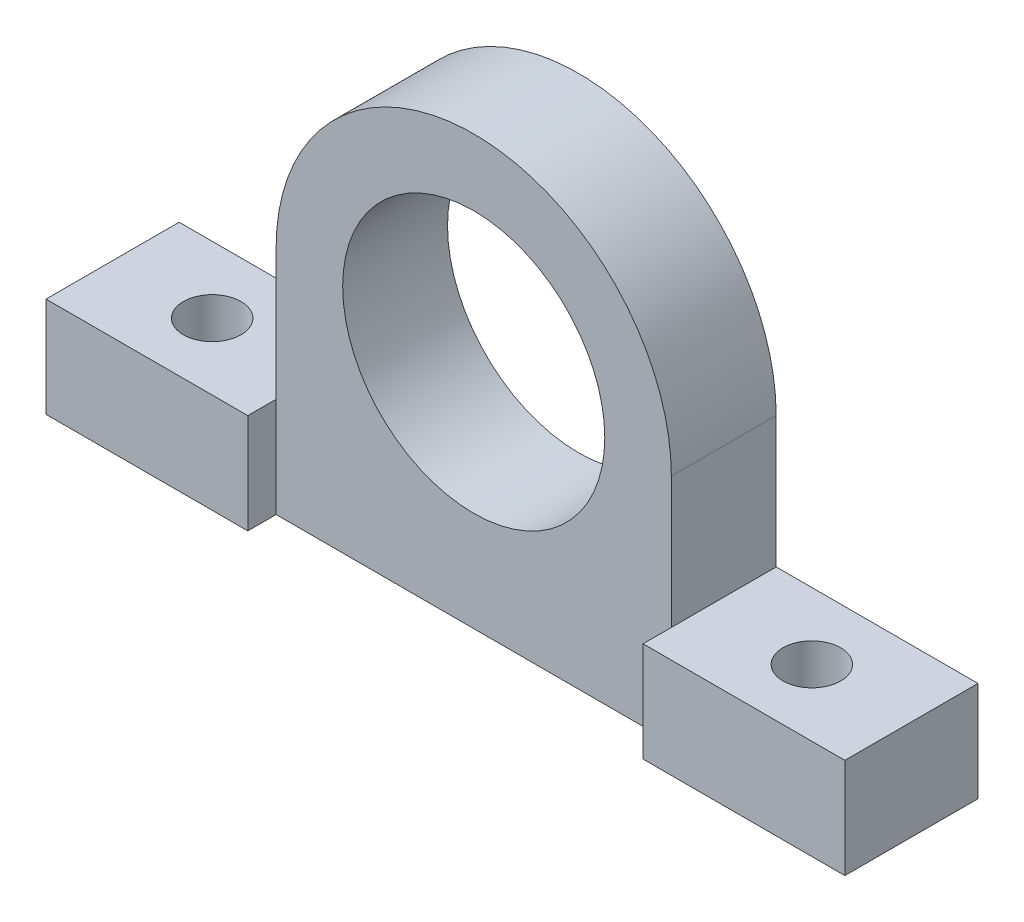
ISO-10303-21;
HEADER;
FILE_DESCRIPTION(('STEP AP214'),'2;1');
FILE_NAME('part.step','',(''),(''),'','','');
FILE_SCHEMA(('AUTOMOTIVE_DESIGN { 1 0 10303 214 1 1 1 1 }'));
ENDSEC;
DATA;
#1=APPLICATION_CONTEXT('core data for automotive mechanical design processes');
#2=APPLICATION_PROTOCOL_DEFINITION('international standard','automotive_design',2000,#1);
#3=PRODUCT_CONTEXT('',#1,'mechanical');
#4=PRODUCT('Part','Part','',(#3));
#5=PRODUCT_RELATED_PRODUCT_CATEGORY('part','',(#4));
#6=PRODUCT_DEFINITION_FORMATION('','',#4);
#7=PRODUCT_DEFINITION_CONTEXT('part definition',#1,'design');
#8=PRODUCT_DEFINITION('design','',#6,#7);
#9=PRODUCT_DEFINITION_SHAPE('','',#8);
#10=(LENGTH_UNIT() NAMED_UNIT(*) SI_UNIT(.MILLI.,.METRE.));
#11=(NAMED_UNIT(*) PLANE_ANGLE_UNIT() SI_UNIT($,.RADIAN.));
#12=(NAMED_UNIT(*) SI_UNIT($,.STERADIAN.) SOLID_ANGLE_UNIT());
#13=UNCERTAINTY_MEASURE_WITH_UNIT(LENGTH_MEASURE(1.E-05),#10,'distance_accuracy_value','');
#14=(GEOMETRIC_REPRESENTATION_CONTEXT(3) GLOBAL_UNCERTAINTY_ASSIGNED_CONTEXT((#13)) GLOBAL_UNIT_ASSIGNED_CONTEXT((#10,
#11,#12)) REPRESENTATION_CONTEXT('',''));
#15=CARTESIAN_POINT('',(0.,0.,0.));
#16=DIRECTION('',(0.,0.,1.));
#17=DIRECTION('',(1.,0.,0.));
#18=AXIS2_PLACEMENT_3D('',#15,#16,#17);
#19=CARTESIAN_POINT('',(0.,0.,20.));
#20=DIRECTION('',(0.,0.,1.));
#21=DIRECTION('',(1.,0.,0.));
#22=AXIS2_PLACEMENT_3D('',#19,#20,#21);
#23=PLANE('',#22);
#24=CARTESIAN_POINT('',(0.,0.,20.));
#25=DIRECTION('',(0.,0.,1.));
#26=DIRECTION('',(1.,0.,0.));
#27=AXIS2_PLACEMENT_3D('',#24,#25,#26);
#28=CIRCLE('',#27,25.);
#29=CARTESIAN_POINT('',(25.,0.,20.));
#30=VERTEX_POINT('',#29);
#31=EDGE_CURVE('E106',#30,#30,#28,.T.);
#32=ORIENTED_EDGE('',*,*,#31,.F.);
#33=EDGE_LOOP('',(#32));
#34=FACE_BOUND('',#33,.T.);
#35=DIRECTION('',(1.,0.,0.));
#36=VECTOR('',#35,1.);
#37=CARTESIAN_POINT('',(0.,-44.05,20.));
#38=LINE('',#37,#36);
#39=CARTESIAN_POINT('',(-37.7,-44.05,20.));
#40=VERTEX_POINT('',#39);
#41=CARTESIAN_POINT('',(37.7,-44.05,20.));
#42=VERTEX_POINT('',#41);
#43=EDGE_CURVE('E142',#40,#42,#38,.T.);
#44=ORIENTED_EDGE('',*,*,#43,.T.);
#45=DIRECTION('',(0.,-1.,0.));
#46=VECTOR('',#45,1.);
#47=CARTESIAN_POINT('',(37.7,0.,20.));
#48=LINE('',#47,#46);
#49=CARTESIAN_POINT('',(37.7,-25.,20.));
#50=VERTEX_POINT('',#49);
#51=EDGE_CURVE('E158',#50,#42,#48,.T.);
#52=ORIENTED_EDGE('',*,*,#51,.F.);
#53=DIRECTION('',(0.,1.,0.));
#54=VECTOR('',#53,1.);
#55=CARTESIAN_POINT('',(37.7,0.,20.));
#56=LINE('',#55,#54);
#57=CARTESIAN_POINT('',(37.7,0.,20.));
#58=VERTEX_POINT('',#57);
#59=EDGE_CURVE('E146',#50,#58,#56,.T.);
#60=ORIENTED_EDGE('',*,*,#59,.T.);
#61=CARTESIAN_POINT('',(0.,0.,20.));
#62=DIRECTION('',(0.,0.,1.));
#63=DIRECTION('',(1.,0.,0.));
#64=AXIS2_PLACEMENT_3D('',#61,#62,#63);
#65=CIRCLE('',#64,37.7);
#66=CARTESIAN_POINT('',(-37.7,0.,20.));
#67=VERTEX_POINT('',#66);
#68=EDGE_CURVE('E58',#58,#67,#65,.T.);
#69=ORIENTED_EDGE('',*,*,#68,.T.);
#70=DIRECTION('',(0.,1.,0.));
#71=VECTOR('',#70,1.);
#72=CARTESIAN_POINT('',(-37.7,0.,20.));
#73=LINE('',#72,#71);
#74=CARTESIAN_POINT('',(-37.7,-25.,20.));
#75=VERTEX_POINT('',#74);
#76=EDGE_CURVE('E95',#75,#67,#73,.T.);
#77=ORIENTED_EDGE('',*,*,#76,.F.);
#78=DIRECTION('',(0.,-1.,0.));
#79=VECTOR('',#78,1.);
#80=CARTESIAN_POINT('',(-37.7,0.,20.));
#81=LINE('',#80,#79);
#82=EDGE_CURVE('E147',#75,#40,#81,.T.);
#83=ORIENTED_EDGE('',*,*,#82,.T.);
#84=EDGE_LOOP('',(#44,#52,#60,#69,#77,#83));
#85=FACE_BOUND('',#84,.T.);
#86=ADVANCED_FACE('F32',(#34,#85),#23,.T.);
#87=CARTESIAN_POINT('',(-37.7,0.,20.));
#88=DIRECTION('',(-1.,0.,0.));
#89=DIRECTION('',(0.,0.,1.));
#90=AXIS2_PLACEMENT_3D('',#87,#88,#89);
#91=PLANE('',#90);
#92=DIRECTION('',(0.,1.,0.));
#93=VECTOR('',#92,1.);
#94=CARTESIAN_POINT('',(-37.7,0.,0.));
#95=LINE('',#94,#93);
#96=CARTESIAN_POINT('',(-37.7,-25.,0.));
#97=VERTEX_POINT('',#96);
#98=CARTESIAN_POINT('',(-37.7,0.,0.));
#99=VERTEX_POINT('',#98);
#100=EDGE_CURVE('E93',#97,#99,#95,.T.);
#101=ORIENTED_EDGE('',*,*,#100,.F.);
#102=DIRECTION('',(0.,0.,-1.));
#103=VECTOR('',#102,1.);
#104=CARTESIAN_POINT('',(-37.7,-25.,20.));
#105=LINE('',#104,#103);
#106=EDGE_CURVE('E11',#75,#97,#105,.T.);
#107=ORIENTED_EDGE('',*,*,#106,.F.);
#108=ORIENTED_EDGE('',*,*,#76,.T.);
#109=DIRECTION('',(0.,0.,-1.));
#110=VECTOR('',#109,1.);
#111=CARTESIAN_POINT('',(-37.7,0.,20.));
#112=LINE('',#111,#110);
#113=EDGE_CURVE('E88',#67,#99,#112,.T.);
#114=ORIENTED_EDGE('',*,*,#113,.T.);
#115=EDGE_LOOP('',(#101,#107,#108,#114));
#116=FACE_BOUND('',#115,.T.);
#117=ADVANCED_FACE('F90',(#116),#91,.T.);
#118=CARTESIAN_POINT('',(0.,-25.,20.));
#119=DIRECTION('',(0.,1.,0.));
#120=DIRECTION('',(0.,0.,1.));
#121=AXIS2_PLACEMENT_3D('',#118,#119,#120);
#122=PLANE('',#121);
#123=CARTESIAN_POINT('',(-57.2,-25.,12.7));
#124=DIRECTION('',(0.,1.,0.));
#125=DIRECTION('',(0.,0.,1.));
#126=AXIS2_PLACEMENT_3D('',#123,#124,#125);
#127=CIRCLE('',#126,5.49999999999999);
#128=CARTESIAN_POINT('',(-57.2,-25.,18.2));
#129=VERTEX_POINT('',#128);
#130=EDGE_CURVE('E232',#129,#129,#127,.T.);
#131=ORIENTED_EDGE('',*,*,#130,.F.);
#132=EDGE_LOOP('',(#131));
#133=FACE_BOUND('',#132,.T.);
#134=DIRECTION('',(1.,0.,0.));
#135=VECTOR('',#134,1.);
#136=CARTESIAN_POINT('',(0.,-25.,0.));
#137=LINE('',#136,#135);
#138=CARTESIAN_POINT('',(-76.2,-25.,0.));
#139=VERTEX_POINT('',#138);
#140=EDGE_CURVE('E112',#139,#97,#137,.T.);
#141=ORIENTED_EDGE('',*,*,#140,.F.);
#142=DIRECTION('',(0.,0.,-1.));
#143=VECTOR('',#142,1.);
#144=CARTESIAN_POINT('',(-76.2,-25.,20.));
#145=LINE('',#144,#143);
#146=CARTESIAN_POINT('',(-76.2,-25.,25.4));
#147=VERTEX_POINT('',#146);
#148=EDGE_CURVE('E41',#147,#139,#145,.T.);
#149=ORIENTED_EDGE('',*,*,#148,.F.);
#150=DIRECTION('',(-1.,0.,0.));
#151=VECTOR('',#150,1.);
#152=CARTESIAN_POINT('',(0.,-25.,25.4));
#153=LINE('',#152,#151);
#154=CARTESIAN_POINT('',(-37.7,-25.,25.4));
#155=VERTEX_POINT('',#154);
#156=EDGE_CURVE('E208',#155,#147,#153,.T.);
#157=ORIENTED_EDGE('',*,*,#156,.F.);
#158=DIRECTION('',(0.,0.,-1.));
#159=VECTOR('',#158,1.);
#160=CARTESIAN_POINT('',(-37.7,-25.,25.4));
#161=LINE('',#160,#159);
#162=EDGE_CURVE('E119',#155,#75,#161,.T.);
#163=ORIENTED_EDGE('',*,*,#162,.T.);
#164=ORIENTED_EDGE('',*,*,#106,.T.);
#165=EDGE_LOOP('',(#141,#149,#157,#163,#164));
#166=FACE_BOUND('',#165,.T.);
#167=ADVANCED_FACE('F192',(#133,#166),#122,.T.);
#168=CARTESIAN_POINT('',(-76.2,0.,20.));
#169=DIRECTION('',(-1.,0.,0.));
#170=DIRECTION('',(0.,0.,1.));
#171=AXIS2_PLACEMENT_3D('',#168,#169,#170);
#172=PLANE('',#171);
#173=DIRECTION('',(0.,1.,0.));
#174=VECTOR('',#173,1.);
#175=CARTESIAN_POINT('',(-76.2,0.,0.));
#176=LINE('',#175,#174);
#177=CARTESIAN_POINT('',(-76.2,-44.05,0.));
#178=VERTEX_POINT('',#177);
#179=EDGE_CURVE('E115',#178,#139,#176,.T.);
#180=ORIENTED_EDGE('',*,*,#179,.F.);
#181=DIRECTION('',(0.,0.,-1.));
#182=VECTOR('',#181,1.);
#183=CARTESIAN_POINT('',(-76.2,-44.05,20.));
#184=LINE('',#183,#182);
#185=CARTESIAN_POINT('',(-76.2,-44.05,25.4));
#186=VERTEX_POINT('',#185);
#187=EDGE_CURVE('E139',#186,#178,#184,.T.);
#188=ORIENTED_EDGE('',*,*,#187,.F.);
#189=DIRECTION('',(0.,-1.,0.));
#190=VECTOR('',#189,1.);
#191=CARTESIAN_POINT('',(-76.2,0.,25.4));
#192=LINE('',#191,#190);
#193=EDGE_CURVE('E188',#147,#186,#192,.T.);
#194=ORIENTED_EDGE('',*,*,#193,.F.);
#195=ORIENTED_EDGE('',*,*,#148,.T.);
#196=EDGE_LOOP('',(#180,#188,#194,#195));
#197=FACE_BOUND('',#196,.T.);
#198=ADVANCED_FACE('F182',(#197),#172,.T.);
#199=CARTESIAN_POINT('',(0.,-44.05,20.));
#200=DIRECTION('',(0.,1.,0.));
#201=DIRECTION('',(0.,0.,1.));
#202=AXIS2_PLACEMENT_3D('',#199,#200,#201);
#203=PLANE('',#202);
#204=CARTESIAN_POINT('',(-57.2,-44.05,12.7));
#205=DIRECTION('',(0.,1.,0.));
#206=DIRECTION('',(0.,0.,1.));
#207=AXIS2_PLACEMENT_3D('',#204,#205,#206);
#208=CIRCLE('',#207,5.49999999999999);
#209=CARTESIAN_POINT('',(-57.2,-44.05,18.2));
#210=VERTEX_POINT('',#209);
#211=EDGE_CURVE('E36',#210,#210,#208,.T.);
#212=ORIENTED_EDGE('',*,*,#211,.T.);
#213=EDGE_LOOP('',(#212));
#214=FACE_BOUND('',#213,.T.);
#215=CARTESIAN_POINT('',(57.2,-44.05,12.7));
#216=DIRECTION('',(0.,1.,0.));
#217=DIRECTION('',(0.,0.,1.));
#218=AXIS2_PLACEMENT_3D('',#215,#216,#217);
#219=CIRCLE('',#218,5.49999999999999);
#220=CARTESIAN_POINT('',(57.2,-44.05,18.2));
#221=VERTEX_POINT('',#220);
#222=EDGE_CURVE('E220',#221,#221,#219,.T.);
#223=ORIENTED_EDGE('',*,*,#222,.T.);
#224=EDGE_LOOP('',(#223));
#225=FACE_BOUND('',#224,.T.);
#226=DIRECTION('',(1.,0.,0.));
#227=VECTOR('',#226,1.);
#228=CARTESIAN_POINT('',(0.,-44.05,0.));
#229=LINE('',#228,#227);
#230=CARTESIAN_POINT('',(76.2,-44.05,0.));
#231=VERTEX_POINT('',#230);
#232=EDGE_CURVE('E124',#178,#231,#229,.T.);
#233=ORIENTED_EDGE('',*,*,#232,.T.);
#234=DIRECTION('',(0.,0.,-1.));
#235=VECTOR('',#234,1.);
#236=CARTESIAN_POINT('',(76.2,-44.05,20.));
#237=LINE('',#236,#235);
#238=CARTESIAN_POINT('',(76.2,-44.05,25.4));
#239=VERTEX_POINT('',#238);
#240=EDGE_CURVE('E136',#239,#231,#237,.T.);
#241=ORIENTED_EDGE('',*,*,#240,.F.);
#242=DIRECTION('',(1.,0.,0.));
#243=VECTOR('',#242,1.);
#244=CARTESIAN_POINT('',(0.,-44.05,25.4));
#245=LINE('',#244,#243);
#246=CARTESIAN_POINT('',(37.7,-44.05,25.4));
#247=VERTEX_POINT('',#246);
#248=EDGE_CURVE('E222',#247,#239,#245,.T.);
#249=ORIENTED_EDGE('',*,*,#248,.F.);
#250=DIRECTION('',(0.,0.,-1.));
#251=VECTOR('',#250,1.);
#252=CARTESIAN_POINT('',(37.7,-44.05,25.4));
#253=LINE('',#252,#251);
#254=EDGE_CURVE('E215',#247,#42,#253,.T.);
#255=ORIENTED_EDGE('',*,*,#254,.T.);
#256=ORIENTED_EDGE('',*,*,#43,.F.);
#257=DIRECTION('',(0.,0.,-1.));
#258=VECTOR('',#257,1.);
#259=CARTESIAN_POINT('',(-37.7,-44.05,25.4));
#260=LINE('',#259,#258);
#261=CARTESIAN_POINT('',(-37.7,-44.05,25.4));
#262=VERTEX_POINT('',#261);
#263=EDGE_CURVE('E49',#262,#40,#260,.T.);
#264=ORIENTED_EDGE('',*,*,#263,.F.);
#265=DIRECTION('',(1.,0.,0.));
#266=VECTOR('',#265,1.);
#267=CARTESIAN_POINT('',(0.,-44.05,25.4));
#268=LINE('',#267,#266);
#269=EDGE_CURVE('E204',#186,#262,#268,.T.);
#270=ORIENTED_EDGE('',*,*,#269,.F.);
#271=ORIENTED_EDGE('',*,*,#187,.T.);
#272=EDGE_LOOP('',(#233,#241,#249,#255,#256,#264,#270,#271));
#273=FACE_BOUND('',#272,.T.);
#274=ADVANCED_FACE('F239',(#214,#225,#273),#203,.F.);
#275=CARTESIAN_POINT('',(76.2,0.,20.));
#276=DIRECTION('',(-1.,0.,0.));
#277=DIRECTION('',(0.,0.,1.));
#278=AXIS2_PLACEMENT_3D('',#275,#276,#277);
#279=PLANE('',#278);
#280=DIRECTION('',(0.,1.,0.));
#281=VECTOR('',#280,1.);
#282=CARTESIAN_POINT('',(76.2,0.,0.));
#283=LINE('',#282,#281);
#284=CARTESIAN_POINT('',(76.2,-25.,0.));
#285=VERTEX_POINT('',#284);
#286=EDGE_CURVE('E127',#231,#285,#283,.T.);
#287=ORIENTED_EDGE('',*,*,#286,.T.);
#288=DIRECTION('',(0.,0.,-1.));
#289=VECTOR('',#288,1.);
#290=CARTESIAN_POINT('',(76.2,-25.,20.));
#291=LINE('',#290,#289);
#292=CARTESIAN_POINT('',(76.2,-25.,25.4));
#293=VERTEX_POINT('',#292);
#294=EDGE_CURVE('E134',#293,#285,#291,.T.);
#295=ORIENTED_EDGE('',*,*,#294,.F.);
#296=DIRECTION('',(0.,1.,0.));
#297=VECTOR('',#296,1.);
#298=CARTESIAN_POINT('',(76.2,0.,25.4));
#299=LINE('',#298,#297);
#300=EDGE_CURVE('E218',#239,#293,#299,.T.);
#301=ORIENTED_EDGE('',*,*,#300,.F.);
#302=ORIENTED_EDGE('',*,*,#240,.T.);
#303=EDGE_LOOP('',(#287,#295,#301,#302));
#304=FACE_BOUND('',#303,.T.);
#305=ADVANCED_FACE('F175',(#304),#279,.F.);
#306=CARTESIAN_POINT('',(57.2,-25.,12.7));
#307=DIRECTION('',(0.,1.,0.));
#308=DIRECTION('',(0.,0.,1.));
#309=AXIS2_PLACEMENT_3D('',#306,#307,#308);
#310=CIRCLE('',#309,5.49999999999999);
#311=CARTESIAN_POINT('',(57.2,-25.,18.2));
#312=VERTEX_POINT('',#311);
#313=EDGE_CURVE('E229',#312,#312,#310,.T.);
#314=ORIENTED_EDGE('',*,*,#313,.F.);
#315=EDGE_LOOP('',(#314));
#316=FACE_BOUND('',#315,.T.);
#317=CARTESIAN_POINT('',(37.7,-25.,0.));
#318=VERTEX_POINT('',#317);
#319=EDGE_CURVE('E117',#318,#285,#137,.T.);
#320=ORIENTED_EDGE('',*,*,#319,.F.);
#321=DIRECTION('',(0.,0.,-1.));
#322=VECTOR('',#321,1.);
#323=CARTESIAN_POINT('',(37.7,-25.,20.));
#324=LINE('',#323,#322);
#325=EDGE_CURVE('E132',#50,#318,#324,.T.);
#326=ORIENTED_EDGE('',*,*,#325,.F.);
#327=DIRECTION('',(0.,0.,-1.));
#328=VECTOR('',#327,1.);
#329=CARTESIAN_POINT('',(37.7,-25.,25.4));
#330=LINE('',#329,#328);
#331=CARTESIAN_POINT('',(37.7,-25.,25.4));
#332=VERTEX_POINT('',#331);
#333=EDGE_CURVE('E212',#332,#50,#330,.T.);
#334=ORIENTED_EDGE('',*,*,#333,.F.);
#335=DIRECTION('',(-1.,0.,0.));
#336=VECTOR('',#335,1.);
#337=CARTESIAN_POINT('',(0.,-25.,25.4));
#338=LINE('',#337,#336);
#339=EDGE_CURVE('E171',#293,#332,#338,.T.);
#340=ORIENTED_EDGE('',*,*,#339,.F.);
#341=ORIENTED_EDGE('',*,*,#294,.T.);
#342=EDGE_LOOP('',(#320,#326,#334,#340,#341));
#343=FACE_BOUND('',#342,.T.);
#344=ADVANCED_FACE('F165',(#316,#343),#122,.T.);
#345=CARTESIAN_POINT('',(37.7,0.,20.));
#346=DIRECTION('',(-1.,0.,0.));
#347=DIRECTION('',(0.,0.,1.));
#348=AXIS2_PLACEMENT_3D('',#345,#346,#347);
#349=PLANE('',#348);
#350=DIRECTION('',(0.,1.,0.));
#351=VECTOR('',#350,1.);
#352=CARTESIAN_POINT('',(37.7,0.,0.));
#353=LINE('',#352,#351);
#354=CARTESIAN_POINT('',(37.7,0.,0.));
#355=VERTEX_POINT('',#354);
#356=EDGE_CURVE('E107',#318,#355,#353,.T.);
#357=ORIENTED_EDGE('',*,*,#356,.T.);
#358=DIRECTION('',(0.,0.,-1.));
#359=VECTOR('',#358,1.);
#360=CARTESIAN_POINT('',(37.7,0.,20.));
#361=LINE('',#360,#359);
#362=EDGE_CURVE('E97',#58,#355,#361,.T.);
#363=ORIENTED_EDGE('',*,*,#362,.F.);
#364=ORIENTED_EDGE('',*,*,#59,.F.);
#365=ORIENTED_EDGE('',*,*,#325,.T.);
#366=EDGE_LOOP('',(#357,#363,#364,#365));
#367=FACE_BOUND('',#366,.T.);
#368=ADVANCED_FACE('F161',(#367),#349,.F.);
#369=CARTESIAN_POINT('',(0.,0.,20.));
#370=DIRECTION('',(0.,0.,-1.));
#371=DIRECTION('',(-1.,0.,0.));
#372=AXIS2_PLACEMENT_3D('',#369,#370,#371);
#373=CYLINDRICAL_SURFACE('',#372,25.);
#374=ORIENTED_EDGE('',*,*,#31,.T.);
#375=EDGE_LOOP('',(#374));
#376=FACE_BOUND('',#375,.T.);
#377=CARTESIAN_POINT('',(0.,0.,0.));
#378=DIRECTION('',(0.,0.,1.));
#379=DIRECTION('',(1.,0.,0.));
#380=AXIS2_PLACEMENT_3D('',#377,#378,#379);
#381=CIRCLE('',#380,25.);
#382=CARTESIAN_POINT('',(25.,0.,0.));
#383=VERTEX_POINT('',#382);
#384=EDGE_CURVE('E113',#383,#383,#381,.T.);
#385=ORIENTED_EDGE('',*,*,#384,.F.);
#386=EDGE_LOOP('',(#385));
#387=FACE_BOUND('',#386,.T.);
#388=ADVANCED_FACE('F34',(#376,#387),#373,.F.);
#389=CARTESIAN_POINT('',(0.,0.,20.));
#390=DIRECTION('',(0.,0.,-1.));
#391=DIRECTION('',(-1.,0.,0.));
#392=AXIS2_PLACEMENT_3D('',#389,#390,#391);
#393=CYLINDRICAL_SURFACE('',#392,37.7);
#394=CARTESIAN_POINT('',(0.,0.,0.));
#395=DIRECTION('',(0.,0.,1.));
#396=DIRECTION('',(1.,0.,0.));
#397=AXIS2_PLACEMENT_3D('',#394,#395,#396);
#398=CIRCLE('',#397,37.7);
#399=EDGE_CURVE('E100',#355,#99,#398,.T.);
#400=ORIENTED_EDGE('',*,*,#399,.T.);
#401=ORIENTED_EDGE('',*,*,#113,.F.);
#402=ORIENTED_EDGE('',*,*,#68,.F.);
#403=ORIENTED_EDGE('',*,*,#362,.T.);
#404=EDGE_LOOP('',(#400,#401,#402,#403));
#405=FACE_BOUND('',#404,.T.);
#406=ADVANCED_FACE('F101',(#405),#393,.T.);
#407=CARTESIAN_POINT('',(0.,0.,0.));
#408=DIRECTION('',(0.,0.,1.));
#409=DIRECTION('',(1.,0.,0.));
#410=AXIS2_PLACEMENT_3D('',#407,#408,#409);
#411=PLANE('',#410);
#412=ORIENTED_EDGE('',*,*,#384,.T.);
#413=EDGE_LOOP('',(#412));
#414=FACE_BOUND('',#413,.T.);
#415=ORIENTED_EDGE('',*,*,#100,.T.);
#416=ORIENTED_EDGE('',*,*,#399,.F.);
#417=ORIENTED_EDGE('',*,*,#356,.F.);
#418=ORIENTED_EDGE('',*,*,#319,.T.);
#419=ORIENTED_EDGE('',*,*,#286,.F.);
#420=ORIENTED_EDGE('',*,*,#232,.F.);
#421=ORIENTED_EDGE('',*,*,#179,.T.);
#422=ORIENTED_EDGE('',*,*,#140,.T.);
#423=EDGE_LOOP('',(#415,#416,#417,#418,#419,#420,#421,#422));
#424=FACE_BOUND('',#423,.T.);
#425=ADVANCED_FACE('F109',(#414,#424),#411,.F.);
#426=CARTESIAN_POINT('',(-37.7,0.,25.4));
#427=DIRECTION('',(1.,0.,0.));
#428=DIRECTION('',(0.,1.,0.));
#429=AXIS2_PLACEMENT_3D('',#426,#427,#428);
#430=PLANE('',#429);
#431=ORIENTED_EDGE('',*,*,#82,.F.);
#432=ORIENTED_EDGE('',*,*,#162,.F.);
#433=DIRECTION('',(0.,-1.,0.));
#434=VECTOR('',#433,1.);
#435=CARTESIAN_POINT('',(-37.7,0.,25.4));
#436=LINE('',#435,#434);
#437=EDGE_CURVE('E210',#155,#262,#436,.T.);
#438=ORIENTED_EDGE('',*,*,#437,.T.);
#439=ORIENTED_EDGE('',*,*,#263,.T.);
#440=EDGE_LOOP('',(#431,#432,#438,#439));
#441=FACE_BOUND('',#440,.T.);
#442=ADVANCED_FACE('F260',(#441),#430,.T.);
#443=CARTESIAN_POINT('',(0.,0.,25.4));
#444=DIRECTION('',(0.,0.,1.));
#445=DIRECTION('',(1.,0.,0.));
#446=AXIS2_PLACEMENT_3D('',#443,#444,#445);
#447=PLANE('',#446);
#448=ORIENTED_EDGE('',*,*,#437,.F.);
#449=ORIENTED_EDGE('',*,*,#156,.T.);
#450=ORIENTED_EDGE('',*,*,#193,.T.);
#451=ORIENTED_EDGE('',*,*,#269,.T.);
#452=EDGE_LOOP('',(#448,#449,#450,#451));
#453=FACE_BOUND('',#452,.T.);
#454=ADVANCED_FACE('F325',(#453),#447,.T.);
#455=CARTESIAN_POINT('',(37.7,0.,25.4));
#456=DIRECTION('',(1.,0.,0.));
#457=DIRECTION('',(0.,1.,0.));
#458=AXIS2_PLACEMENT_3D('',#455,#456,#457);
#459=PLANE('',#458);
#460=ORIENTED_EDGE('',*,*,#51,.T.);
#461=ORIENTED_EDGE('',*,*,#254,.F.);
#462=DIRECTION('',(0.,-1.,0.));
#463=VECTOR('',#462,1.);
#464=CARTESIAN_POINT('',(37.7,0.,25.4));
#465=LINE('',#464,#463);
#466=EDGE_CURVE('E225',#332,#247,#465,.T.);
#467=ORIENTED_EDGE('',*,*,#466,.F.);
#468=ORIENTED_EDGE('',*,*,#333,.T.);
#469=EDGE_LOOP('',(#460,#461,#467,#468));
#470=FACE_BOUND('',#469,.T.);
#471=ADVANCED_FACE('F334',(#470),#459,.F.);
#472=CARTESIAN_POINT('',(0.,0.,25.4));
#473=DIRECTION('',(0.,0.,1.));
#474=DIRECTION('',(1.,0.,0.));
#475=AXIS2_PLACEMENT_3D('',#472,#473,#474);
#476=PLANE('',#475);
#477=ORIENTED_EDGE('',*,*,#339,.T.);
#478=ORIENTED_EDGE('',*,*,#466,.T.);
#479=ORIENTED_EDGE('',*,*,#248,.T.);
#480=ORIENTED_EDGE('',*,*,#300,.T.);
#481=EDGE_LOOP('',(#477,#478,#479,#480));
#482=FACE_BOUND('',#481,.T.);
#483=ADVANCED_FACE('F249',(#482),#476,.T.);
#484=CARTESIAN_POINT('',(57.2,-25.,12.7));
#485=DIRECTION('',(0.,1.,0.));
#486=DIRECTION('',(0.,0.,1.));
#487=AXIS2_PLACEMENT_3D('',#484,#485,#486);
#488=CYLINDRICAL_SURFACE('',#487,5.49999999999999);
#489=ORIENTED_EDGE('',*,*,#313,.T.);
#490=EDGE_LOOP('',(#489));
#491=FACE_BOUND('',#490,.T.);
#492=ORIENTED_EDGE('',*,*,#222,.F.);
#493=EDGE_LOOP('',(#492));
#494=FACE_BOUND('',#493,.T.);
#495=ADVANCED_FACE('F244',(#491,#494),#488,.F.);
#496=CARTESIAN_POINT('',(-57.2,-25.,12.7));
#497=DIRECTION('',(0.,1.,0.));
#498=DIRECTION('',(0.,0.,1.));
#499=AXIS2_PLACEMENT_3D('',#496,#497,#498);
#500=CYLINDRICAL_SURFACE('',#499,5.49999999999999);
#501=ORIENTED_EDGE('',*,*,#130,.T.);
#502=EDGE_LOOP('',(#501));
#503=FACE_BOUND('',#502,.T.);
#504=ORIENTED_EDGE('',*,*,#211,.F.);
#505=EDGE_LOOP('',(#504));
#506=FACE_BOUND('',#505,.T.);
#507=ADVANCED_FACE('F242',(#503,#506),#500,.F.);
#508=CLOSED_SHELL('',(#86,#117,#167,#198,#274,#305,#344,#368,#388,#406,#425,#442,#454,#471,#483,
#495,#507));
#509=MANIFOLD_SOLID_BREP('B2',#508);
#510=ADVANCED_BREP_SHAPE_REPRESENTATION('',(#18,#509),#14);
#511=SHAPE_DEFINITION_REPRESENTATION(#9,#510);
ENDSEC;
END-ISO-10303-21;
